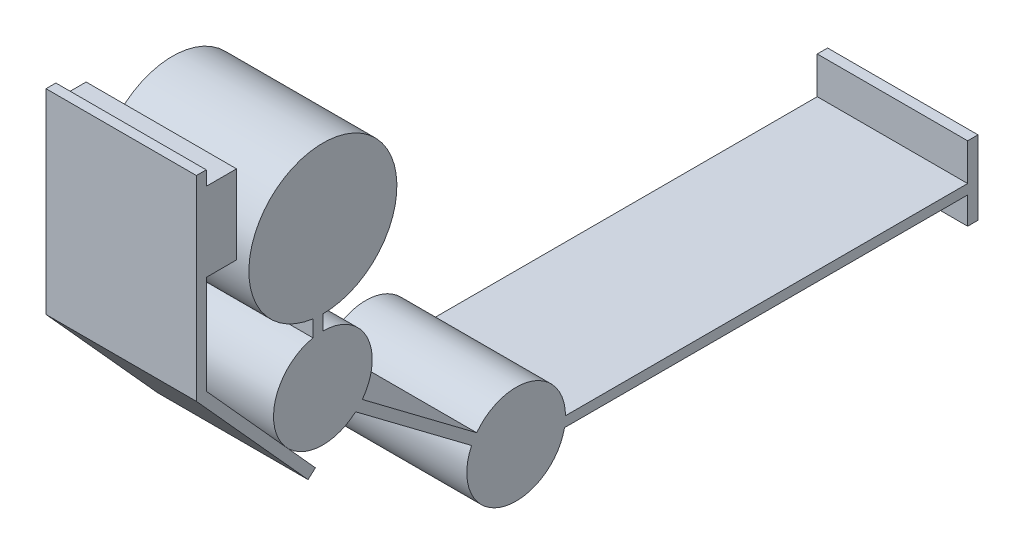
ISO-10303-21;
HEADER;
FILE_DESCRIPTION(('STEP AP214'),'2;1');
FILE_NAME('part.step','',(''),(''),'','','');
FILE_SCHEMA(('AUTOMOTIVE_DESIGN { 1 0 10303 214 1 1 1 1 }'));
ENDSEC;
DATA;
#1=APPLICATION_CONTEXT('core data for automotive mechanical design processes');
#2=APPLICATION_PROTOCOL_DEFINITION('international standard','automotive_design',2000,#1);
#3=PRODUCT_CONTEXT('',#1,'mechanical');
#4=PRODUCT('Part','Part','',(#3));
#5=PRODUCT_RELATED_PRODUCT_CATEGORY('part','',(#4));
#6=PRODUCT_DEFINITION_FORMATION('','',#4);
#7=PRODUCT_DEFINITION_CONTEXT('part definition',#1,'design');
#8=PRODUCT_DEFINITION('design','',#6,#7);
#9=PRODUCT_DEFINITION_SHAPE('','',#8);
#10=(LENGTH_UNIT() NAMED_UNIT(*) SI_UNIT(.MILLI.,.METRE.));
#11=(NAMED_UNIT(*) PLANE_ANGLE_UNIT() SI_UNIT($,.RADIAN.));
#12=(NAMED_UNIT(*) SI_UNIT($,.STERADIAN.) SOLID_ANGLE_UNIT());
#13=UNCERTAINTY_MEASURE_WITH_UNIT(LENGTH_MEASURE(1.E-05),#10,'distance_accuracy_value','');
#14=(GEOMETRIC_REPRESENTATION_CONTEXT(3) GLOBAL_UNCERTAINTY_ASSIGNED_CONTEXT((#13)) GLOBAL_UNIT_ASSIGNED_CONTEXT((#10,
#11,#12)) REPRESENTATION_CONTEXT('',''));
#15=CARTESIAN_POINT('',(0.,0.,0.));
#16=DIRECTION('',(0.,0.,1.));
#17=DIRECTION('',(1.,0.,0.));
#18=AXIS2_PLACEMENT_3D('',#15,#16,#17);
#19=CARTESIAN_POINT('',(304.8,0.,788.372890289523));
#20=DIRECTION('',(0.,0.,-1.));
#21=DIRECTION('',(-1.,0.,0.));
#22=AXIS2_PLACEMENT_3D('',#19,#20,#21);
#23=PLANE('',#22);
#24=DIRECTION('',(0.,-1.,0.));
#25=VECTOR('',#24,1.);
#26=CARTESIAN_POINT('',(0.,0.,788.372890289523));
#27=LINE('',#26,#25);
#28=CARTESIAN_POINT('',(0.,188.904441864782,788.372890289523));
#29=VERTEX_POINT('',#28);
#30=CARTESIAN_POINT('',(0.,158.904441864782,788.372890289523));
#31=VERTEX_POINT('',#30);
#32=EDGE_CURVE('E318',#29,#31,#27,.T.);
#33=ORIENTED_EDGE('',*,*,#32,.F.);
#34=DIRECTION('',(-1.,0.,0.));
#35=VECTOR('',#34,1.);
#36=CARTESIAN_POINT('',(304.8,188.904441864782,788.372890289523));
#37=LINE('',#36,#35);
#38=CARTESIAN_POINT('',(304.8,188.904441864782,788.372890289523));
#39=VERTEX_POINT('',#38);
#40=EDGE_CURVE('E360',#39,#29,#37,.T.);
#41=ORIENTED_EDGE('',*,*,#40,.F.);
#42=DIRECTION('',(0.,-1.,0.));
#43=VECTOR('',#42,1.);
#44=CARTESIAN_POINT('',(304.8,0.,788.372890289523));
#45=LINE('',#44,#43);
#46=CARTESIAN_POINT('',(304.8,158.904441864782,788.372890289523));
#47=VERTEX_POINT('',#46);
#48=EDGE_CURVE('E315',#39,#47,#45,.T.);
#49=ORIENTED_EDGE('',*,*,#48,.T.);
#50=DIRECTION('',(-1.,0.,0.));
#51=VECTOR('',#50,1.);
#52=CARTESIAN_POINT('',(304.8,158.904441864782,788.372890289523));
#53=LINE('',#52,#51);
#54=EDGE_CURVE('E357',#47,#31,#53,.T.);
#55=ORIENTED_EDGE('',*,*,#54,.T.);
#56=EDGE_LOOP('',(#33,#41,#49,#55));
#57=FACE_BOUND('',#56,.T.);
#58=ADVANCED_FACE('F187',(#57),#23,.T.);
#59=CARTESIAN_POINT('',(304.8,58.9044418647818,788.372890289523));
#60=DIRECTION('',(-1.,0.,0.));
#61=DIRECTION('',(0.,0.,1.));
#62=AXIS2_PLACEMENT_3D('',#59,#60,#61);
#63=CYLINDRICAL_SURFACE('',#62,100.);
#64=CARTESIAN_POINT('',(0.,58.9044418647818,788.372890289523));
#65=DIRECTION('',(1.,0.,0.));
#66=DIRECTION('',(0.,0.,-1.));
#67=AXIS2_PLACEMENT_3D('',#64,#65,#66);
#68=CIRCLE('',#67,100.);
#69=CARTESIAN_POINT('',(0.,-1.18830713719755,708.442536121753));
#70=VERTEX_POINT('',#69);
#71=EDGE_CURVE('E366',#70,#31,#68,.T.);
#72=ORIENTED_EDGE('',*,*,#71,.T.);
#73=ORIENTED_EDGE('',*,*,#54,.F.);
#74=CARTESIAN_POINT('',(304.8,58.9044418647818,788.372890289523));
#75=DIRECTION('',(1.,0.,0.));
#76=DIRECTION('',(0.,0.,-1.));
#77=AXIS2_PLACEMENT_3D('',#74,#75,#76);
#78=CIRCLE('',#77,100.);
#79=CARTESIAN_POINT('',(304.8,-1.18830713719755,708.442536121753));
#80=VERTEX_POINT('',#79);
#81=EDGE_CURVE('E403',#80,#47,#78,.T.);
#82=ORIENTED_EDGE('',*,*,#81,.F.);
#83=DIRECTION('',(-1.,0.,0.));
#84=VECTOR('',#83,1.);
#85=CARTESIAN_POINT('',(304.8,-1.18830713719755,708.442536121753));
#86=LINE('',#85,#84);
#87=EDGE_CURVE('E354',#80,#70,#86,.T.);
#88=ORIENTED_EDGE('',*,*,#87,.T.);
#89=EDGE_LOOP('',(#72,#73,#82,#88));
#90=FACE_BOUND('',#89,.T.);
#91=ADVANCED_FACE('F517',(#90),#63,.T.);
#92=CARTESIAN_POINT('',(304.8,-341.040770973571,256.399182299884));
#93=DIRECTION('',(0.,0.799303541677698,-0.600927490019793));
#94=DIRECTION('',(0.,0.600927490019793,0.799303541677698));
#95=AXIS2_PLACEMENT_3D('',#92,#93,#94);
#96=PLANE('',#95);
#97=DIRECTION('',(0.,-0.600927490019793,-0.799303541677698));
#98=VECTOR('',#97,1.);
#99=CARTESIAN_POINT('',(0.,-341.040770973571,256.399182299884));
#100=LINE('',#99,#98);
#101=CARTESIAN_POINT('',(0.,-175.457279242937,476.644509035221));
#102=VERTEX_POINT('',#101);
#103=EDGE_CURVE('E370',#70,#102,#100,.T.);
#104=ORIENTED_EDGE('',*,*,#103,.F.);
#105=ORIENTED_EDGE('',*,*,#87,.F.);
#106=DIRECTION('',(0.,-0.600927490019793,-0.799303541677698));
#107=VECTOR('',#106,1.);
#108=CARTESIAN_POINT('',(304.8,-341.040770973571,256.399182299884));
#109=LINE('',#108,#107);
#110=CARTESIAN_POINT('',(304.8,-175.457279242937,476.644509035221));
#111=VERTEX_POINT('',#110);
#112=EDGE_CURVE('E406',#80,#111,#109,.T.);
#113=ORIENTED_EDGE('',*,*,#112,.T.);
#114=DIRECTION('',(-1.,0.,0.));
#115=VECTOR('',#114,1.);
#116=CARTESIAN_POINT('',(304.8,-175.457279242937,476.644509035221));
#117=LINE('',#116,#115);
#118=EDGE_CURVE('E351',#111,#102,#117,.T.);
#119=ORIENTED_EDGE('',*,*,#118,.T.);
#120=EDGE_LOOP('',(#104,#105,#113,#119));
#121=FACE_BOUND('',#120,.T.);
#122=ADVANCED_FACE('F523',(#121),#96,.T.);
#123=CARTESIAN_POINT('',(304.8,338.904441864782,788.372890289523));
#124=DIRECTION('',(-1.,0.,0.));
#125=DIRECTION('',(0.,0.,1.));
#126=AXIS2_PLACEMENT_3D('',#123,#124,#125);
#127=CYLINDRICAL_SURFACE('',#126,150.);
#128=CARTESIAN_POINT('',(0.,338.904441864782,788.372890289523));
#129=DIRECTION('',(1.,0.,0.));
#130=DIRECTION('',(0.,0.,-1.));
#131=AXIS2_PLACEMENT_3D('',#128,#129,#130);
#132=CIRCLE('',#131,150.);
#133=CARTESIAN_POINT('',(0.,190.243754391597,808.372890289523));
#134=VERTEX_POINT('',#133);
#135=EDGE_CURVE('E321',#29,#134,#132,.T.);
#136=ORIENTED_EDGE('',*,*,#135,.T.);
#137=DIRECTION('',(-1.,0.,0.));
#138=VECTOR('',#137,1.);
#139=CARTESIAN_POINT('',(304.8,190.243754391597,808.372890289523));
#140=LINE('',#139,#138);
#141=CARTESIAN_POINT('',(304.8,190.243754391597,808.372890289523));
#142=VERTEX_POINT('',#141);
#143=EDGE_CURVE('E307',#142,#134,#140,.T.);
#144=ORIENTED_EDGE('',*,*,#143,.F.);
#145=CARTESIAN_POINT('',(304.8,338.904441864782,788.372890289523));
#146=DIRECTION('',(1.,0.,0.));
#147=DIRECTION('',(0.,0.,-1.));
#148=AXIS2_PLACEMENT_3D('',#145,#146,#147);
#149=CIRCLE('',#148,150.);
#150=EDGE_CURVE('E191',#39,#142,#149,.T.);
#151=ORIENTED_EDGE('',*,*,#150,.F.);
#152=ORIENTED_EDGE('',*,*,#40,.T.);
#153=EDGE_LOOP('',(#136,#144,#151,#152));
#154=FACE_BOUND('',#153,.T.);
#155=ADVANCED_FACE('F319',(#154),#127,.T.);
#156=CARTESIAN_POINT('',(304.8,-235.550028244917,396.714154867451));
#157=DIRECTION('',(-1.,0.,0.));
#158=DIRECTION('',(0.,0.,1.));
#159=AXIS2_PLACEMENT_3D('',#156,#157,#158);
#160=CYLINDRICAL_SURFACE('',#159,100.);
#161=CARTESIAN_POINT('',(0.,-235.550028244917,396.714154867451));
#162=DIRECTION('',(1.,0.,0.));
#163=DIRECTION('',(0.,0.,-1.));
#164=AXIS2_PLACEMENT_3D('',#161,#162,#163);
#165=CIRCLE('',#164,100.);
#166=CARTESIAN_POINT('',(0.,-235.550028244917,296.714154867451));
#167=VERTEX_POINT('',#166);
#168=EDGE_CURVE('E374',#167,#102,#165,.T.);
#169=ORIENTED_EDGE('',*,*,#168,.T.);
#170=ORIENTED_EDGE('',*,*,#118,.F.);
#171=CARTESIAN_POINT('',(304.8,-235.550028244917,396.714154867451));
#172=DIRECTION('',(1.,0.,0.));
#173=DIRECTION('',(0.,0.,-1.));
#174=AXIS2_PLACEMENT_3D('',#171,#172,#173);
#175=CIRCLE('',#174,100.);
#176=CARTESIAN_POINT('',(304.8,-235.550028244917,296.714154867451));
#177=VERTEX_POINT('',#176);
#178=EDGE_CURVE('E410',#177,#111,#175,.T.);
#179=ORIENTED_EDGE('',*,*,#178,.F.);
#180=DIRECTION('',(-1.,0.,0.));
#181=VECTOR('',#180,1.);
#182=CARTESIAN_POINT('',(304.8,-235.550028244917,296.714154867451));
#183=LINE('',#182,#181);
#184=EDGE_CURVE('E348',#177,#167,#183,.T.);
#185=ORIENTED_EDGE('',*,*,#184,.T.);
#186=EDGE_LOOP('',(#169,#170,#179,#185));
#187=FACE_BOUND('',#186,.T.);
#188=ADVANCED_FACE('F542',(#187),#160,.T.);
#189=CARTESIAN_POINT('',(304.8,-235.550028244917,396.714154867451));
#190=DIRECTION('',(-1.,0.,0.));
#191=DIRECTION('',(0.,0.,1.));
#192=AXIS2_PLACEMENT_3D('',#189,#190,#191);
#193=CYLINDRICAL_SURFACE('',#192,100.);
#194=CARTESIAN_POINT('',(0.,-235.550028244917,396.714154867451));
#195=DIRECTION('',(1.,0.,0.));
#196=DIRECTION('',(0.,0.,-1.));
#197=AXIS2_PLACEMENT_3D('',#194,#195,#196);
#198=CIRCLE('',#197,100.);
#199=CARTESIAN_POINT('',(0.,-192.657470160074,487.048137736238));
#200=VERTEX_POINT('',#199);
#201=CARTESIAN_POINT('',(0.,-255.550028244917,298.734565156124));
#202=VERTEX_POINT('',#201);
#203=EDGE_CURVE('E386',#200,#202,#198,.T.);
#204=ORIENTED_EDGE('',*,*,#203,.T.);
#205=DIRECTION('',(-1.,0.,0.));
#206=VECTOR('',#205,1.);
#207=CARTESIAN_POINT('',(304.8,-255.550028244917,298.734565156124));
#208=LINE('',#207,#206);
#209=CARTESIAN_POINT('',(304.8,-255.550028244917,298.734565156124));
#210=VERTEX_POINT('',#209);
#211=EDGE_CURVE('E338',#210,#202,#208,.T.);
#212=ORIENTED_EDGE('',*,*,#211,.F.);
#213=CARTESIAN_POINT('',(304.8,-235.550028244917,396.714154867451));
#214=DIRECTION('',(1.,0.,0.));
#215=DIRECTION('',(0.,0.,-1.));
#216=AXIS2_PLACEMENT_3D('',#213,#214,#215);
#217=CIRCLE('',#216,100.);
#218=CARTESIAN_POINT('',(304.8,-192.657470160074,487.048137736238));
#219=VERTEX_POINT('',#218);
#220=EDGE_CURVE('E421',#219,#210,#217,.T.);
#221=ORIENTED_EDGE('',*,*,#220,.F.);
#222=DIRECTION('',(-1.,0.,0.));
#223=VECTOR('',#222,1.);
#224=CARTESIAN_POINT('',(304.8,-192.657470160074,487.048137736238));
#225=LINE('',#224,#223);
#226=EDGE_CURVE('E334',#219,#200,#225,.T.);
#227=ORIENTED_EDGE('',*,*,#226,.T.);
#228=EDGE_LOOP('',(#204,#212,#221,#227));
#229=FACE_BOUND('',#228,.T.);
#230=ADVANCED_FACE('F438',(#229),#193,.T.);
#231=CARTESIAN_POINT('',(304.8,0.,808.372890289523));
#232=DIRECTION('',(0.,0.,-1.));
#233=DIRECTION('',(-1.,0.,0.));
#234=AXIS2_PLACEMENT_3D('',#231,#232,#233);
#235=PLANE('',#234);
#236=DIRECTION('',(0.,-1.,0.));
#237=VECTOR('',#236,1.);
#238=CARTESIAN_POINT('',(0.,0.,808.372890289523));
#239=LINE('',#238,#237);
#240=CARTESIAN_POINT('',(0.,156.884031576109,808.372890289523));
#241=VERTEX_POINT('',#240);
#242=EDGE_CURVE('E395',#134,#241,#239,.T.);
#243=ORIENTED_EDGE('',*,*,#242,.T.);
#244=DIRECTION('',(-1.,0.,0.));
#245=VECTOR('',#244,1.);
#246=CARTESIAN_POINT('',(304.8,156.884031576109,808.372890289523));
#247=LINE('',#246,#245);
#248=CARTESIAN_POINT('',(304.8,156.884031576109,808.372890289523));
#249=VERTEX_POINT('',#248);
#250=EDGE_CURVE('E309',#249,#241,#247,.T.);
#251=ORIENTED_EDGE('',*,*,#250,.F.);
#252=DIRECTION('',(0.,-1.,0.));
#253=VECTOR('',#252,1.);
#254=CARTESIAN_POINT('',(304.8,0.,808.372890289523));
#255=LINE('',#254,#253);
#256=EDGE_CURVE('E302',#142,#249,#255,.T.);
#257=ORIENTED_EDGE('',*,*,#256,.F.);
#258=ORIENTED_EDGE('',*,*,#143,.T.);
#259=EDGE_LOOP('',(#243,#251,#257,#258));
#260=FACE_BOUND('',#259,.T.);
#261=ADVANCED_FACE('F305',(#260),#235,.F.);
#262=CARTESIAN_POINT('',(304.8,-357.026841807125,268.41773210028));
#263=DIRECTION('',(0.,0.799303541677698,-0.600927490019793));
#264=DIRECTION('',(0.,0.600927490019793,0.799303541677698));
#265=AXIS2_PLACEMENT_3D('',#262,#263,#264);
#266=PLANE('',#265);
#267=DIRECTION('',(0.,-0.600927490019793,-0.799303541677698));
#268=VECTOR('',#267,1.);
#269=CARTESIAN_POINT('',(0.,-357.026841807125,268.41773210028));
#270=LINE('',#269,#268);
#271=CARTESIAN_POINT('',(0.,-15.9602578871692,722.076007021527));
#272=VERTEX_POINT('',#271);
#273=EDGE_CURVE('E389',#272,#200,#270,.T.);
#274=ORIENTED_EDGE('',*,*,#273,.T.);
#275=ORIENTED_EDGE('',*,*,#226,.F.);
#276=DIRECTION('',(0.,-0.600927490019793,-0.799303541677698));
#277=VECTOR('',#276,1.);
#278=CARTESIAN_POINT('',(304.8,-357.026841807125,268.41773210028));
#279=LINE('',#278,#277);
#280=CARTESIAN_POINT('',(304.8,-15.9602578871692,722.076007021527));
#281=VERTEX_POINT('',#280);
#282=EDGE_CURVE('E424',#281,#219,#279,.T.);
#283=ORIENTED_EDGE('',*,*,#282,.F.);
#284=DIRECTION('',(-1.,0.,0.));
#285=VECTOR('',#284,1.);
#286=CARTESIAN_POINT('',(304.8,-15.9602578871692,722.076007021527));
#287=LINE('',#286,#285);
#288=EDGE_CURVE('E325',#281,#272,#287,.T.);
#289=ORIENTED_EDGE('',*,*,#288,.T.);
#290=EDGE_LOOP('',(#274,#275,#283,#289));
#291=FACE_BOUND('',#290,.T.);
#292=ADVANCED_FACE('F433',(#291),#266,.F.);
#293=CARTESIAN_POINT('',(0.,0.,0.));
#294=DIRECTION('',(1.,0.,0.));
#295=DIRECTION('',(0.,0.,-1.));
#296=AXIS2_PLACEMENT_3D('',#293,#294,#295);
#297=PLANE('',#296);
#298=ORIENTED_EDGE('',*,*,#135,.F.);
#299=ORIENTED_EDGE('',*,*,#32,.T.);
#300=ORIENTED_EDGE('',*,*,#71,.F.);
#301=ORIENTED_EDGE('',*,*,#103,.T.);
#302=ORIENTED_EDGE('',*,*,#168,.F.);
#303=DIRECTION('',(0.,0.,-1.));
#304=VECTOR('',#303,1.);
#305=CARTESIAN_POINT('',(0.,-235.550028244917,0.));
#306=LINE('',#305,#304);
#307=CARTESIAN_POINT('',(0.,-235.550028244917,-518.285845132549));
#308=VERTEX_POINT('',#307);
#309=EDGE_CURVE('E378',#167,#308,#306,.T.);
#310=ORIENTED_EDGE('',*,*,#309,.T.);
#311=DIRECTION('',(0.,-1.,0.));
#312=VECTOR('',#311,1.);
#313=CARTESIAN_POINT('',(0.,-160.550028244917,-518.285845132549));
#314=LINE('',#313,#312);
#315=CARTESIAN_POINT('',(0.,-160.550028244917,-518.285845132549));
#316=VERTEX_POINT('',#315);
#317=EDGE_CURVE('E469',#316,#308,#314,.T.);
#318=ORIENTED_EDGE('',*,*,#317,.F.);
#319=DIRECTION('',(0.,0.,-1.));
#320=VECTOR('',#319,1.);
#321=CARTESIAN_POINT('',(0.,-160.550028244917,-518.285845132549));
#322=LINE('',#321,#320);
#323=CARTESIAN_POINT('',(0.,-160.550028244917,-539.267073435126));
#324=VERTEX_POINT('',#323);
#325=EDGE_CURVE('E473',#316,#324,#322,.T.);
#326=ORIENTED_EDGE('',*,*,#325,.T.);
#327=DIRECTION('',(0.,-1.,0.));
#328=VECTOR('',#327,1.);
#329=CARTESIAN_POINT('',(0.,-160.550028244917,-539.267073435126));
#330=LINE('',#329,#328);
#331=CARTESIAN_POINT('',(0.,-310.550028244917,-539.267073435126));
#332=VERTEX_POINT('',#331);
#333=EDGE_CURVE('E13',#324,#332,#330,.T.);
#334=ORIENTED_EDGE('',*,*,#333,.T.);
#335=DIRECTION('',(0.,0.,1.));
#336=VECTOR('',#335,1.);
#337=CARTESIAN_POINT('',(0.,-310.550028244917,-539.267073435126));
#338=LINE('',#337,#336);
#339=CARTESIAN_POINT('',(0.,-310.550028244917,-518.285845132549));
#340=VERTEX_POINT('',#339);
#341=EDGE_CURVE('E198',#332,#340,#338,.T.);
#342=ORIENTED_EDGE('',*,*,#341,.T.);
#343=CARTESIAN_POINT('',(0.,-255.550028244917,-518.285845132549));
#344=VERTEX_POINT('',#343);
#345=EDGE_CURVE('E468',#344,#340,#314,.T.);
#346=ORIENTED_EDGE('',*,*,#345,.F.);
#347=DIRECTION('',(0.,0.,-1.));
#348=VECTOR('',#347,1.);
#349=CARTESIAN_POINT('',(0.,-255.550028244917,0.));
#350=LINE('',#349,#348);
#351=EDGE_CURVE('E382',#202,#344,#350,.T.);
#352=ORIENTED_EDGE('',*,*,#351,.F.);
#353=ORIENTED_EDGE('',*,*,#203,.F.);
#354=ORIENTED_EDGE('',*,*,#273,.F.);
#355=CARTESIAN_POINT('',(0.,58.9044418647818,788.372890289523));
#356=DIRECTION('',(1.,0.,0.));
#357=DIRECTION('',(0.,0.,-1.));
#358=AXIS2_PLACEMENT_3D('',#355,#356,#357);
#359=CIRCLE('',#358,100.);
#360=EDGE_CURVE('E392',#241,#272,#359,.T.);
#361=ORIENTED_EDGE('',*,*,#360,.F.);
#362=ORIENTED_EDGE('',*,*,#242,.F.);
#363=EDGE_LOOP('',(#298,#299,#300,#301,#302,#310,#318,#326,#334,#342,#346,#352,#353,#354,#361,#362));
#364=FACE_BOUND('',#363,.T.);
#365=ADVANCED_FACE('F490',(#364),#297,.F.);
#366=CARTESIAN_POINT('',(304.8,0.,0.));
#367=DIRECTION('',(1.,0.,0.));
#368=DIRECTION('',(0.,0.,-1.));
#369=AXIS2_PLACEMENT_3D('',#366,#367,#368);
#370=PLANE('',#369);
#371=ORIENTED_EDGE('',*,*,#150,.T.);
#372=ORIENTED_EDGE('',*,*,#256,.T.);
#373=CARTESIAN_POINT('',(304.8,58.9044418647818,788.372890289523));
#374=DIRECTION('',(1.,0.,0.));
#375=DIRECTION('',(0.,0.,-1.));
#376=AXIS2_PLACEMENT_3D('',#373,#374,#375);
#377=CIRCLE('',#376,100.);
#378=EDGE_CURVE('E296',#249,#281,#377,.T.);
#379=ORIENTED_EDGE('',*,*,#378,.T.);
#380=ORIENTED_EDGE('',*,*,#282,.T.);
#381=ORIENTED_EDGE('',*,*,#220,.T.);
#382=DIRECTION('',(0.,0.,-1.));
#383=VECTOR('',#382,1.);
#384=CARTESIAN_POINT('',(304.8,-255.550028244917,0.));
#385=LINE('',#384,#383);
#386=CARTESIAN_POINT('',(304.8,-255.550028244917,-518.285845132549));
#387=VERTEX_POINT('',#386);
#388=EDGE_CURVE('E417',#210,#387,#385,.T.);
#389=ORIENTED_EDGE('',*,*,#388,.T.);
#390=DIRECTION('',(0.,-1.,0.));
#391=VECTOR('',#390,1.);
#392=CARTESIAN_POINT('',(304.8,-160.550028244917,-518.285845132549));
#393=LINE('',#392,#391);
#394=CARTESIAN_POINT('',(304.8,-310.550028244917,-518.285845132549));
#395=VERTEX_POINT('',#394);
#396=EDGE_CURVE('E442',#387,#395,#393,.T.);
#397=ORIENTED_EDGE('',*,*,#396,.T.);
#398=DIRECTION('',(0.,0.,1.));
#399=VECTOR('',#398,1.);
#400=CARTESIAN_POINT('',(304.8,-310.550028244917,-539.267073435126));
#401=LINE('',#400,#399);
#402=CARTESIAN_POINT('',(304.8,-310.550028244917,-539.267073435126));
#403=VERTEX_POINT('',#402);
#404=EDGE_CURVE('E454',#403,#395,#401,.T.);
#405=ORIENTED_EDGE('',*,*,#404,.F.);
#406=DIRECTION('',(0.,-1.,0.));
#407=VECTOR('',#406,1.);
#408=CARTESIAN_POINT('',(304.8,-160.550028244917,-539.267073435126));
#409=LINE('',#408,#407);
#410=CARTESIAN_POINT('',(304.8,-160.550028244917,-539.267073435126));
#411=VERTEX_POINT('',#410);
#412=EDGE_CURVE('E328',#411,#403,#409,.T.);
#413=ORIENTED_EDGE('',*,*,#412,.F.);
#414=DIRECTION('',(0.,0.,-1.));
#415=VECTOR('',#414,1.);
#416=CARTESIAN_POINT('',(304.8,-160.550028244917,-518.285845132549));
#417=LINE('',#416,#415);
#418=CARTESIAN_POINT('',(304.8,-160.550028244917,-518.285845132549));
#419=VERTEX_POINT('',#418);
#420=EDGE_CURVE('E460',#419,#411,#417,.T.);
#421=ORIENTED_EDGE('',*,*,#420,.F.);
#422=CARTESIAN_POINT('',(304.8,-235.550028244917,-518.285845132549));
#423=VERTEX_POINT('',#422);
#424=EDGE_CURVE('E455',#419,#423,#393,.T.);
#425=ORIENTED_EDGE('',*,*,#424,.T.);
#426=DIRECTION('',(0.,0.,-1.));
#427=VECTOR('',#426,1.);
#428=CARTESIAN_POINT('',(304.8,-235.550028244917,0.));
#429=LINE('',#428,#427);
#430=EDGE_CURVE('E413',#177,#423,#429,.T.);
#431=ORIENTED_EDGE('',*,*,#430,.F.);
#432=ORIENTED_EDGE('',*,*,#178,.T.);
#433=ORIENTED_EDGE('',*,*,#112,.F.);
#434=ORIENTED_EDGE('',*,*,#81,.T.);
#435=ORIENTED_EDGE('',*,*,#48,.F.);
#436=EDGE_LOOP('',(#371,#372,#379,#380,#381,#389,#397,#405,#413,#421,#425,#431,#432,#433,#434,#435));
#437=FACE_BOUND('',#436,.T.);
#438=ADVANCED_FACE('F189',(#437),#370,.T.);
#439=CARTESIAN_POINT('',(304.8,58.9044418647818,788.372890289523));
#440=DIRECTION('',(-1.,0.,0.));
#441=DIRECTION('',(0.,0.,1.));
#442=AXIS2_PLACEMENT_3D('',#439,#440,#441);
#443=CYLINDRICAL_SURFACE('',#442,100.);
#444=ORIENTED_EDGE('',*,*,#378,.F.);
#445=ORIENTED_EDGE('',*,*,#250,.T.);
#446=ORIENTED_EDGE('',*,*,#360,.T.);
#447=ORIENTED_EDGE('',*,*,#288,.F.);
#448=EDGE_LOOP('',(#444,#445,#446,#447));
#449=FACE_BOUND('',#448,.T.);
#450=ADVANCED_FACE('F430',(#449),#443,.T.);
#451=CARTESIAN_POINT('',(304.8,-255.550028244917,0.));
#452=DIRECTION('',(0.,1.,0.));
#453=DIRECTION('',(0.,0.,1.));
#454=AXIS2_PLACEMENT_3D('',#451,#452,#453);
#455=PLANE('',#454);
#456=ORIENTED_EDGE('',*,*,#351,.T.);
#457=DIRECTION('',(-1.,0.,0.));
#458=VECTOR('',#457,1.);
#459=CARTESIAN_POINT('',(304.8,-255.550028244917,-518.285845132549));
#460=LINE('',#459,#458);
#461=EDGE_CURVE('E342',#387,#344,#460,.T.);
#462=ORIENTED_EDGE('',*,*,#461,.F.);
#463=ORIENTED_EDGE('',*,*,#388,.F.);
#464=ORIENTED_EDGE('',*,*,#211,.T.);
#465=EDGE_LOOP('',(#456,#462,#463,#464));
#466=FACE_BOUND('',#465,.T.);
#467=ADVANCED_FACE('F445',(#466),#455,.F.);
#468=CARTESIAN_POINT('',(304.8,-235.550028244917,0.));
#469=DIRECTION('',(0.,1.,0.));
#470=DIRECTION('',(0.,0.,1.));
#471=AXIS2_PLACEMENT_3D('',#468,#469,#470);
#472=PLANE('',#471);
#473=ORIENTED_EDGE('',*,*,#309,.F.);
#474=ORIENTED_EDGE('',*,*,#184,.F.);
#475=ORIENTED_EDGE('',*,*,#430,.T.);
#476=DIRECTION('',(-1.,0.,0.));
#477=VECTOR('',#476,1.);
#478=CARTESIAN_POINT('',(304.8,-235.550028244917,-518.285845132549));
#479=LINE('',#478,#477);
#480=EDGE_CURVE('E345',#423,#308,#479,.T.);
#481=ORIENTED_EDGE('',*,*,#480,.T.);
#482=EDGE_LOOP('',(#473,#474,#475,#481));
#483=FACE_BOUND('',#482,.T.);
#484=ADVANCED_FACE('F511',(#483),#472,.T.);
#485=CARTESIAN_POINT('',(304.8,-160.550028244917,-539.267073435126));
#486=DIRECTION('',(0.,0.,-1.));
#487=DIRECTION('',(-1.,0.,0.));
#488=AXIS2_PLACEMENT_3D('',#485,#486,#487);
#489=PLANE('',#488);
#490=ORIENTED_EDGE('',*,*,#333,.F.);
#491=DIRECTION('',(-1.,0.,0.));
#492=VECTOR('',#491,1.);
#493=CARTESIAN_POINT('',(304.8,-160.550028244917,-539.267073435126));
#494=LINE('',#493,#492);
#495=EDGE_CURVE('E400',#411,#324,#494,.T.);
#496=ORIENTED_EDGE('',*,*,#495,.F.);
#497=ORIENTED_EDGE('',*,*,#412,.T.);
#498=DIRECTION('',(-1.,0.,0.));
#499=VECTOR('',#498,1.);
#500=CARTESIAN_POINT('',(304.8,-310.550028244917,-539.267073435126));
#501=LINE('',#500,#499);
#502=EDGE_CURVE('E207',#403,#332,#501,.T.);
#503=ORIENTED_EDGE('',*,*,#502,.T.);
#504=EDGE_LOOP('',(#490,#496,#497,#503));
#505=FACE_BOUND('',#504,.T.);
#506=ADVANCED_FACE('F493',(#505),#489,.T.);
#507=CARTESIAN_POINT('',(304.8,-160.550028244917,-518.285845132549));
#508=DIRECTION('',(0.,1.,0.));
#509=DIRECTION('',(0.,0.,1.));
#510=AXIS2_PLACEMENT_3D('',#507,#508,#509);
#511=PLANE('',#510);
#512=ORIENTED_EDGE('',*,*,#325,.F.);
#513=DIRECTION('',(-1.,0.,0.));
#514=VECTOR('',#513,1.);
#515=CARTESIAN_POINT('',(304.8,-160.550028244917,-518.285845132549));
#516=LINE('',#515,#514);
#517=EDGE_CURVE('E480',#419,#316,#516,.T.);
#518=ORIENTED_EDGE('',*,*,#517,.F.);
#519=ORIENTED_EDGE('',*,*,#420,.T.);
#520=ORIENTED_EDGE('',*,*,#495,.T.);
#521=EDGE_LOOP('',(#512,#518,#519,#520));
#522=FACE_BOUND('',#521,.T.);
#523=ADVANCED_FACE('F503',(#522),#511,.T.);
#524=CARTESIAN_POINT('',(304.8,-310.550028244917,-539.267073435126));
#525=DIRECTION('',(0.,-1.,0.));
#526=DIRECTION('',(0.,0.,-1.));
#527=AXIS2_PLACEMENT_3D('',#524,#525,#526);
#528=PLANE('',#527);
#529=ORIENTED_EDGE('',*,*,#341,.F.);
#530=ORIENTED_EDGE('',*,*,#502,.F.);
#531=ORIENTED_EDGE('',*,*,#404,.T.);
#532=DIRECTION('',(-1.,0.,0.));
#533=VECTOR('',#532,1.);
#534=CARTESIAN_POINT('',(304.8,-310.550028244917,-518.285845132549));
#535=LINE('',#534,#533);
#536=EDGE_CURVE('E451',#395,#340,#535,.T.);
#537=ORIENTED_EDGE('',*,*,#536,.T.);
#538=EDGE_LOOP('',(#529,#530,#531,#537));
#539=FACE_BOUND('',#538,.T.);
#540=ADVANCED_FACE('F488',(#539),#528,.T.);
#541=CARTESIAN_POINT('',(304.8,-160.550028244917,-518.285845132549));
#542=DIRECTION('',(0.,0.,-1.));
#543=DIRECTION('',(-1.,0.,0.));
#544=AXIS2_PLACEMENT_3D('',#541,#542,#543);
#545=PLANE('',#544);
#546=ORIENTED_EDGE('',*,*,#396,.F.);
#547=ORIENTED_EDGE('',*,*,#461,.T.);
#548=ORIENTED_EDGE('',*,*,#345,.T.);
#549=ORIENTED_EDGE('',*,*,#536,.F.);
#550=EDGE_LOOP('',(#546,#547,#548,#549));
#551=FACE_BOUND('',#550,.T.);
#552=ADVANCED_FACE('F449',(#551),#545,.F.);
#553=ORIENTED_EDGE('',*,*,#480,.F.);
#554=ORIENTED_EDGE('',*,*,#424,.F.);
#555=ORIENTED_EDGE('',*,*,#517,.T.);
#556=ORIENTED_EDGE('',*,*,#317,.T.);
#557=EDGE_LOOP('',(#553,#554,#555,#556));
#558=FACE_BOUND('',#557,.T.);
#559=ADVANCED_FACE('F499',(#558),#545,.F.);
#560=CLOSED_SHELL('',(#58,#91,#122,#155,#188,#230,#261,#292,#365,#438,#450,#467,#484,#506,#523,
#540,#552,#559));
#561=MANIFOLD_SOLID_BREP('B2',#560);
#562=CARTESIAN_POINT('',(304.8,171.391607246087,1024.68874642515));
#563=DIRECTION('',(0.,0.67020040640593,-0.742180177081904));
#564=DIRECTION('',(0.,0.742180177081904,0.67020040640593));
#565=AXIS2_PLACEMENT_3D('',#562,#563,#564);
#566=PLANE('',#565);
#567=DIRECTION('',(-1.,0.,0.));
#568=VECTOR('',#567,1.);
#569=CARTESIAN_POINT('',(304.8,-73.5202398105865,803.529485507709));
#570=LINE('',#569,#568);
#571=CARTESIAN_POINT('',(304.8,-73.5202398105865,803.529485507709));
#572=VERTEX_POINT('',#571);
#573=CARTESIAN_POINT('',(0.,-73.5202398105865,803.529485507709));
#574=VERTEX_POINT('',#573);
#575=EDGE_CURVE('E788',#572,#574,#570,.T.);
#576=ORIENTED_EDGE('',*,*,#575,.T.);
#577=DIRECTION('',(0.,-0.742180177081904,-0.67020040640593));
#578=VECTOR('',#577,1.);
#579=CARTESIAN_POINT('',(0.,171.391607246087,1024.68874642515));
#580=LINE('',#579,#578);
#581=CARTESIAN_POINT('',(0.,171.391607246087,1024.68874642515));
#582=VERTEX_POINT('',#581);
#583=EDGE_CURVE('E772',#582,#574,#580,.T.);
#584=ORIENTED_EDGE('',*,*,#583,.F.);
#585=DIRECTION('',(-1.,0.,0.));
#586=VECTOR('',#585,1.);
#587=CARTESIAN_POINT('',(304.8,171.391607246087,1024.68874642515));
#588=LINE('',#587,#586);
#589=CARTESIAN_POINT('',(304.8,171.391607246087,1024.68874642515));
#590=VERTEX_POINT('',#589);
#591=EDGE_CURVE('E786',#590,#582,#588,.T.);
#592=ORIENTED_EDGE('',*,*,#591,.F.);
#593=DIRECTION('',(0.,-0.742180177081904,-0.67020040640593));
#594=VECTOR('',#593,1.);
#595=CARTESIAN_POINT('',(304.8,171.391607246087,1024.68874642515));
#596=LINE('',#595,#594);
#597=EDGE_CURVE('E816',#590,#572,#596,.T.);
#598=ORIENTED_EDGE('',*,*,#597,.T.);
#599=EDGE_LOOP('',(#576,#584,#592,#598));
#600=FACE_BOUND('',#599,.T.);
#601=ADVANCED_FACE('F674',(#600),#566,.T.);
#602=CARTESIAN_POINT('',(304.8,371.220407618039,0.));
#603=DIRECTION('',(0.,-1.,0.));
#604=DIRECTION('',(0.,0.,-1.));
#605=AXIS2_PLACEMENT_3D('',#602,#603,#604);
#606=PLANE('',#605);
#607=DIRECTION('',(0.,0.,1.));
#608=VECTOR('',#607,1.);
#609=CARTESIAN_POINT('',(0.,371.220407618039,0.));
#610=LINE('',#609,#608);
#611=CARTESIAN_POINT('',(0.,371.220407618039,963.372890289523));
#612=VERTEX_POINT('',#611);
#613=CARTESIAN_POINT('',(0.,371.220407618039,1024.68874642515));
#614=VERTEX_POINT('',#613);
#615=EDGE_CURVE('E793',#612,#614,#610,.T.);
#616=ORIENTED_EDGE('',*,*,#615,.F.);
#617=DIRECTION('',(-1.,0.,0.));
#618=VECTOR('',#617,1.);
#619=CARTESIAN_POINT('',(304.8,371.220407618039,963.372890289523));
#620=LINE('',#619,#618);
#621=CARTESIAN_POINT('',(304.8,371.220407618039,963.372890289523));
#622=VERTEX_POINT('',#621);
#623=EDGE_CURVE('E185',#622,#612,#620,.T.);
#624=ORIENTED_EDGE('',*,*,#623,.F.);
#625=DIRECTION('',(0.,0.,1.));
#626=VECTOR('',#625,1.);
#627=CARTESIAN_POINT('',(304.8,371.220407618039,0.));
#628=LINE('',#627,#626);
#629=CARTESIAN_POINT('',(304.8,371.220407618039,1024.68874642515));
#630=VERTEX_POINT('',#629);
#631=EDGE_CURVE('E807',#622,#630,#628,.T.);
#632=ORIENTED_EDGE('',*,*,#631,.T.);
#633=DIRECTION('',(-1.,0.,0.));
#634=VECTOR('',#633,1.);
#635=CARTESIAN_POINT('',(304.8,371.220407618039,1024.68874642515));
#636=LINE('',#635,#634);
#637=EDGE_CURVE('E693',#630,#614,#636,.T.);
#638=ORIENTED_EDGE('',*,*,#637,.T.);
#639=EDGE_LOOP('',(#616,#624,#632,#638));
#640=FACE_BOUND('',#639,.T.);
#641=ADVANCED_FACE('F848',(#640),#606,.T.);
#642=CARTESIAN_POINT('',(304.8,-6.69102392160458E-13,963.372890289523));
#643=DIRECTION('',(0.,0.,-1.));
#644=DIRECTION('',(0.,1.,0.));
#645=AXIS2_PLACEMENT_3D('',#642,#643,#644);
#646=PLANE('',#645);
#647=DIRECTION('',(0.,-1.,0.));
#648=VECTOR('',#647,1.);
#649=CARTESIAN_POINT('',(0.,-6.69102392160458E-13,963.372890289523));
#650=LINE('',#649,#648);
#651=CARTESIAN_POINT('',(0.,531.070196922428,963.372890289523));
#652=VERTEX_POINT('',#651);
#653=EDGE_CURVE('E795',#652,#612,#650,.T.);
#654=ORIENTED_EDGE('',*,*,#653,.F.);
#655=DIRECTION('',(-1.,0.,0.));
#656=VECTOR('',#655,1.);
#657=CARTESIAN_POINT('',(304.8,531.070196922428,963.372890289523));
#658=LINE('',#657,#656);
#659=CARTESIAN_POINT('',(304.8,531.070196922428,963.372890289523));
#660=VERTEX_POINT('',#659);
#661=EDGE_CURVE('E684',#660,#652,#658,.T.);
#662=ORIENTED_EDGE('',*,*,#661,.F.);
#663=DIRECTION('',(0.,-1.,0.));
#664=VECTOR('',#663,1.);
#665=CARTESIAN_POINT('',(304.8,-6.69102392160458E-13,963.372890289523));
#666=LINE('',#665,#664);
#667=EDGE_CURVE('E845',#660,#622,#666,.T.);
#668=ORIENTED_EDGE('',*,*,#667,.T.);
#669=ORIENTED_EDGE('',*,*,#623,.T.);
#670=EDGE_LOOP('',(#654,#662,#668,#669));
#671=FACE_BOUND('',#670,.T.);
#672=ADVANCED_FACE('F843',(#671),#646,.T.);
#673=CARTESIAN_POINT('',(304.8,531.070196922428,0.));
#674=DIRECTION('',(0.,1.,0.));
#675=DIRECTION('',(0.,0.,1.));
#676=AXIS2_PLACEMENT_3D('',#673,#674,#675);
#677=PLANE('',#676);
#678=DIRECTION('',(0.,0.,-1.));
#679=VECTOR('',#678,1.);
#680=CARTESIAN_POINT('',(0.,531.070196922428,0.));
#681=LINE('',#680,#679);
#682=CARTESIAN_POINT('',(0.,531.070196922428,1024.68874642515));
#683=VERTEX_POINT('',#682);
#684=EDGE_CURVE('E799',#683,#652,#681,.T.);
#685=ORIENTED_EDGE('',*,*,#684,.F.);
#686=DIRECTION('',(-1.,0.,0.));
#687=VECTOR('',#686,1.);
#688=CARTESIAN_POINT('',(304.8,531.070196922428,1024.68874642515));
#689=LINE('',#688,#687);
#690=CARTESIAN_POINT('',(304.8,531.070196922428,1024.68874642515));
#691=VERTEX_POINT('',#690);
#692=EDGE_CURVE('E809',#691,#683,#689,.T.);
#693=ORIENTED_EDGE('',*,*,#692,.F.);
#694=DIRECTION('',(0.,0.,-1.));
#695=VECTOR('',#694,1.);
#696=CARTESIAN_POINT('',(304.8,531.070196922428,0.));
#697=LINE('',#696,#695);
#698=EDGE_CURVE('E802',#691,#660,#697,.T.);
#699=ORIENTED_EDGE('',*,*,#698,.T.);
#700=ORIENTED_EDGE('',*,*,#661,.T.);
#701=EDGE_LOOP('',(#685,#693,#699,#700));
#702=FACE_BOUND('',#701,.T.);
#703=ADVANCED_FACE('F838',(#702),#677,.T.);
#704=CARTESIAN_POINT('',(304.8,0.,0.));
#705=DIRECTION('',(1.,0.,0.));
#706=DIRECTION('',(0.,0.,-1.));
#707=AXIS2_PLACEMENT_3D('',#704,#705,#706);
#708=PLANE('',#707);
#709=ORIENTED_EDGE('',*,*,#631,.F.);
#710=ORIENTED_EDGE('',*,*,#667,.F.);
#711=ORIENTED_EDGE('',*,*,#698,.F.);
#712=DIRECTION('',(0.,-1.,0.));
#713=VECTOR('',#712,1.);
#714=CARTESIAN_POINT('',(304.8,559.971929091038,1024.68874642515));
#715=LINE('',#714,#713);
#716=CARTESIAN_POINT('',(304.8,559.971929091038,1024.68874642515));
#717=VERTEX_POINT('',#716);
#718=EDGE_CURVE('E819',#717,#691,#715,.T.);
#719=ORIENTED_EDGE('',*,*,#718,.F.);
#720=DIRECTION('',(0.,0.,-1.));
#721=VECTOR('',#720,1.);
#722=CARTESIAN_POINT('',(304.8,559.971929091038,1044.68874642515));
#723=LINE('',#722,#721);
#724=CARTESIAN_POINT('',(304.8,559.971929091038,1044.68874642515));
#725=VERTEX_POINT('',#724);
#726=EDGE_CURVE('E821',#725,#717,#723,.T.);
#727=ORIENTED_EDGE('',*,*,#726,.F.);
#728=DIRECTION('',(0.,-1.,0.));
#729=VECTOR('',#728,1.);
#730=CARTESIAN_POINT('',(304.8,559.971929091038,1044.68874642515));
#731=LINE('',#730,#729);
#732=CARTESIAN_POINT('',(304.8,163.697794456545,1044.68874642515));
#733=VERTEX_POINT('',#732);
#734=EDGE_CURVE('E764',#725,#733,#731,.T.);
#735=ORIENTED_EDGE('',*,*,#734,.T.);
#736=DIRECTION('',(0.,-0.742180177081904,-0.67020040640593));
#737=VECTOR('',#736,1.);
#738=CARTESIAN_POINT('',(304.8,163.697794456545,1044.68874642515));
#739=LINE('',#738,#737);
#740=CARTESIAN_POINT('',(304.8,-86.9242479387051,818.373089049347));
#741=VERTEX_POINT('',#740);
#742=EDGE_CURVE('E756',#733,#741,#739,.T.);
#743=ORIENTED_EDGE('',*,*,#742,.T.);
#744=DIRECTION('',(0.,0.670200406405931,-0.742180177081903));
#745=VECTOR('',#744,1.);
#746=CARTESIAN_POINT('',(304.8,-86.9242479387051,818.373089049347));
#747=LINE('',#746,#745);
#748=EDGE_CURVE('E813',#741,#572,#747,.T.);
#749=ORIENTED_EDGE('',*,*,#748,.T.);
#750=ORIENTED_EDGE('',*,*,#597,.F.);
#751=EDGE_CURVE('E818',#630,#590,#715,.T.);
#752=ORIENTED_EDGE('',*,*,#751,.F.);
#753=EDGE_LOOP('',(#709,#710,#711,#719,#727,#735,#743,#749,#750,#752));
#754=FACE_BOUND('',#753,.T.);
#755=ADVANCED_FACE('F827',(#754),#708,.T.);
#756=CARTESIAN_POINT('',(0.,0.,0.));
#757=DIRECTION('',(1.,0.,0.));
#758=DIRECTION('',(0.,0.,-1.));
#759=AXIS2_PLACEMENT_3D('',#756,#757,#758);
#760=PLANE('',#759);
#761=ORIENTED_EDGE('',*,*,#615,.T.);
#762=DIRECTION('',(0.,-1.,0.));
#763=VECTOR('',#762,1.);
#764=CARTESIAN_POINT('',(0.,559.971929091038,1024.68874642515));
#765=LINE('',#764,#763);
#766=EDGE_CURVE('E778',#614,#582,#765,.T.);
#767=ORIENTED_EDGE('',*,*,#766,.T.);
#768=ORIENTED_EDGE('',*,*,#583,.T.);
#769=DIRECTION('',(0.,0.670200406405931,-0.742180177081903));
#770=VECTOR('',#769,1.);
#771=CARTESIAN_POINT('',(0.,-86.9242479387051,818.373089049347));
#772=LINE('',#771,#770);
#773=CARTESIAN_POINT('',(0.,-86.9242479387051,818.373089049347));
#774=VERTEX_POINT('',#773);
#775=EDGE_CURVE('E769',#774,#574,#772,.T.);
#776=ORIENTED_EDGE('',*,*,#775,.F.);
#777=DIRECTION('',(0.,-0.742180177081904,-0.67020040640593));
#778=VECTOR('',#777,1.);
#779=CARTESIAN_POINT('',(0.,163.697794456545,1044.68874642515));
#780=LINE('',#779,#778);
#781=CARTESIAN_POINT('',(0.,163.697794456545,1044.68874642515));
#782=VERTEX_POINT('',#781);
#783=EDGE_CURVE('E762',#782,#774,#780,.T.);
#784=ORIENTED_EDGE('',*,*,#783,.F.);
#785=DIRECTION('',(0.,-1.,0.));
#786=VECTOR('',#785,1.);
#787=CARTESIAN_POINT('',(0.,559.971929091038,1044.68874642515));
#788=LINE('',#787,#786);
#789=CARTESIAN_POINT('',(0.,559.971929091038,1044.68874642515));
#790=VERTEX_POINT('',#789);
#791=EDGE_CURVE('E747',#790,#782,#788,.T.);
#792=ORIENTED_EDGE('',*,*,#791,.F.);
#793=DIRECTION('',(0.,0.,-1.));
#794=VECTOR('',#793,1.);
#795=CARTESIAN_POINT('',(0.,559.971929091038,1044.68874642515));
#796=LINE('',#795,#794);
#797=CARTESIAN_POINT('',(0.,559.971929091038,1024.68874642515));
#798=VERTEX_POINT('',#797);
#799=EDGE_CURVE('E757',#790,#798,#796,.T.);
#800=ORIENTED_EDGE('',*,*,#799,.T.);
#801=EDGE_CURVE('E779',#798,#683,#765,.T.);
#802=ORIENTED_EDGE('',*,*,#801,.T.);
#803=ORIENTED_EDGE('',*,*,#684,.T.);
#804=ORIENTED_EDGE('',*,*,#653,.T.);
#805=EDGE_LOOP('',(#761,#767,#768,#776,#784,#792,#800,#802,#803,#804));
#806=FACE_BOUND('',#805,.T.);
#807=ADVANCED_FACE('F767',(#806),#760,.F.);
#808=CARTESIAN_POINT('',(304.8,-86.9242479387051,818.373089049347));
#809=DIRECTION('',(0.,0.742180177081903,0.670200406405931));
#810=DIRECTION('',(0.,-0.670200406405931,0.742180177081903));
#811=AXIS2_PLACEMENT_3D('',#808,#809,#810);
#812=PLANE('',#811);
#813=ORIENTED_EDGE('',*,*,#775,.T.);
#814=ORIENTED_EDGE('',*,*,#575,.F.);
#815=ORIENTED_EDGE('',*,*,#748,.F.);
#816=DIRECTION('',(-1.,0.,0.));
#817=VECTOR('',#816,1.);
#818=CARTESIAN_POINT('',(304.8,-86.9242479387051,818.373089049347));
#819=LINE('',#818,#817);
#820=EDGE_CURVE('E678',#741,#774,#819,.T.);
#821=ORIENTED_EDGE('',*,*,#820,.T.);
#822=EDGE_LOOP('',(#813,#814,#815,#821));
#823=FACE_BOUND('',#822,.T.);
#824=ADVANCED_FACE('F852',(#823),#812,.F.);
#825=CARTESIAN_POINT('',(304.8,559.971929091038,1024.68874642515));
#826=DIRECTION('',(0.,0.,-1.));
#827=DIRECTION('',(-1.,0.,0.));
#828=AXIS2_PLACEMENT_3D('',#825,#826,#827);
#829=PLANE('',#828);
#830=ORIENTED_EDGE('',*,*,#637,.F.);
#831=ORIENTED_EDGE('',*,*,#751,.T.);
#832=ORIENTED_EDGE('',*,*,#591,.T.);
#833=ORIENTED_EDGE('',*,*,#766,.F.);
#834=EDGE_LOOP('',(#830,#831,#832,#833));
#835=FACE_BOUND('',#834,.T.);
#836=ADVANCED_FACE('F849',(#835),#829,.T.);
#837=ORIENTED_EDGE('',*,*,#718,.T.);
#838=ORIENTED_EDGE('',*,*,#692,.T.);
#839=ORIENTED_EDGE('',*,*,#801,.F.);
#840=DIRECTION('',(-1.,0.,0.));
#841=VECTOR('',#840,1.);
#842=CARTESIAN_POINT('',(304.8,559.971929091038,1024.68874642515));
#843=LINE('',#842,#841);
#844=EDGE_CURVE('E784',#717,#798,#843,.T.);
#845=ORIENTED_EDGE('',*,*,#844,.F.);
#846=EDGE_LOOP('',(#837,#838,#839,#845));
#847=FACE_BOUND('',#846,.T.);
#848=ADVANCED_FACE('F833',(#847),#829,.T.);
#849=CARTESIAN_POINT('',(304.8,559.971929091038,1044.68874642515));
#850=DIRECTION('',(0.,1.,0.));
#851=DIRECTION('',(0.,0.,1.));
#852=AXIS2_PLACEMENT_3D('',#849,#850,#851);
#853=PLANE('',#852);
#854=ORIENTED_EDGE('',*,*,#799,.F.);
#855=DIRECTION('',(-1.,0.,0.));
#856=VECTOR('',#855,1.);
#857=CARTESIAN_POINT('',(304.8,559.971929091038,1044.68874642515));
#858=LINE('',#857,#856);
#859=EDGE_CURVE('E744',#725,#790,#858,.T.);
#860=ORIENTED_EDGE('',*,*,#859,.F.);
#861=ORIENTED_EDGE('',*,*,#726,.T.);
#862=ORIENTED_EDGE('',*,*,#844,.T.);
#863=EDGE_LOOP('',(#854,#860,#861,#862));
#864=FACE_BOUND('',#863,.T.);
#865=ADVANCED_FACE('F835',(#864),#853,.T.);
#866=CARTESIAN_POINT('',(304.8,559.971929091038,1044.68874642515));
#867=DIRECTION('',(0.,0.,-1.));
#868=DIRECTION('',(-1.,0.,0.));
#869=AXIS2_PLACEMENT_3D('',#866,#867,#868);
#870=PLANE('',#869);
#871=ORIENTED_EDGE('',*,*,#791,.T.);
#872=DIRECTION('',(-1.,0.,0.));
#873=VECTOR('',#872,1.);
#874=CARTESIAN_POINT('',(304.8,163.697794456545,1044.68874642515));
#875=LINE('',#874,#873);
#876=EDGE_CURVE('E750',#733,#782,#875,.T.);
#877=ORIENTED_EDGE('',*,*,#876,.F.);
#878=ORIENTED_EDGE('',*,*,#734,.F.);
#879=ORIENTED_EDGE('',*,*,#859,.T.);
#880=EDGE_LOOP('',(#871,#877,#878,#879));
#881=FACE_BOUND('',#880,.T.);
#882=ADVANCED_FACE('F749',(#881),#870,.F.);
#883=CARTESIAN_POINT('',(304.8,163.697794456545,1044.68874642515));
#884=DIRECTION('',(0.,0.67020040640593,-0.742180177081904));
#885=DIRECTION('',(0.,0.742180177081904,0.67020040640593));
#886=AXIS2_PLACEMENT_3D('',#883,#884,#885);
#887=PLANE('',#886);
#888=ORIENTED_EDGE('',*,*,#783,.T.);
#889=ORIENTED_EDGE('',*,*,#820,.F.);
#890=ORIENTED_EDGE('',*,*,#742,.F.);
#891=ORIENTED_EDGE('',*,*,#876,.T.);
#892=EDGE_LOOP('',(#888,#889,#890,#891));
#893=FACE_BOUND('',#892,.T.);
#894=ADVANCED_FACE('F676',(#893),#887,.F.);
#895=CLOSED_SHELL('',(#601,#641,#672,#703,#755,#807,#824,#836,#848,#865,#882,#894));
#896=MANIFOLD_SOLID_BREP('B7',#895);
#897=ADVANCED_BREP_SHAPE_REPRESENTATION('',(#18,#561,#896),#14);
#898=SHAPE_DEFINITION_REPRESENTATION(#9,#897);
ENDSEC;
END-ISO-10303-21;
